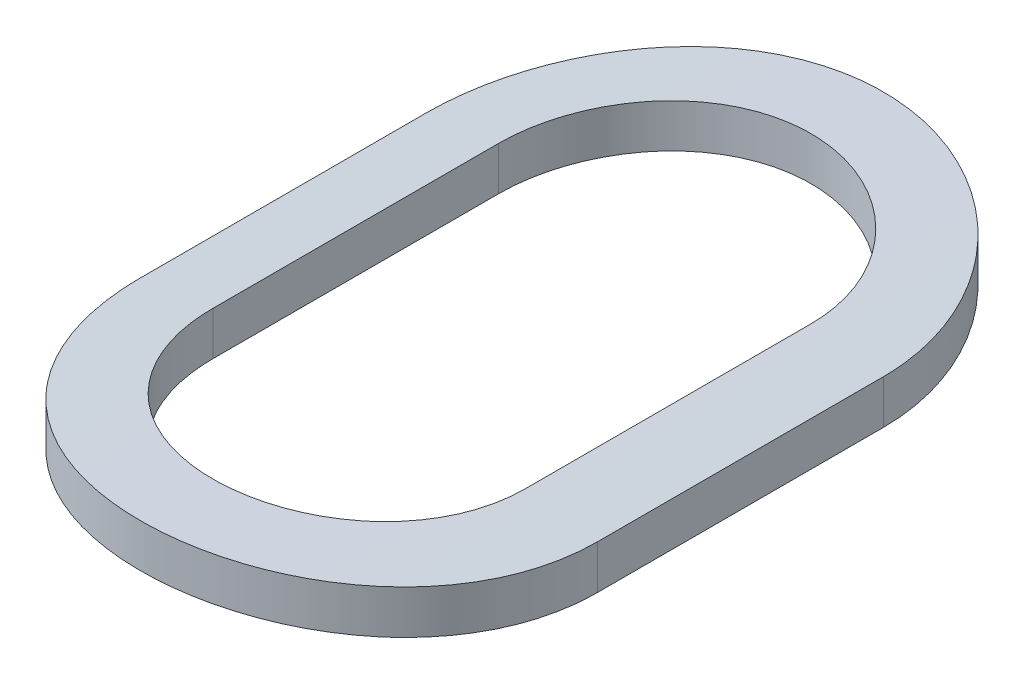
ISO-10303-21;
HEADER;
FILE_DESCRIPTION(('STEP AP214'),'2;1');
FILE_NAME('part.step','',(''),(''),'','','');
FILE_SCHEMA(('AUTOMOTIVE_DESIGN { 1 0 10303 214 1 1 1 1 }'));
ENDSEC;
DATA;
#1=APPLICATION_CONTEXT('core data for automotive mechanical design processes');
#2=APPLICATION_PROTOCOL_DEFINITION('international standard','automotive_design',2000,#1);
#3=PRODUCT_CONTEXT('',#1,'mechanical');
#4=PRODUCT('Part','Part','',(#3));
#5=PRODUCT_RELATED_PRODUCT_CATEGORY('part','',(#4));
#6=PRODUCT_DEFINITION_FORMATION('','',#4);
#7=PRODUCT_DEFINITION_CONTEXT('part definition',#1,'design');
#8=PRODUCT_DEFINITION('design','',#6,#7);
#9=PRODUCT_DEFINITION_SHAPE('','',#8);
#10=(LENGTH_UNIT() NAMED_UNIT(*) SI_UNIT(.MILLI.,.METRE.));
#11=(NAMED_UNIT(*) PLANE_ANGLE_UNIT() SI_UNIT($,.RADIAN.));
#12=(NAMED_UNIT(*) SI_UNIT($,.STERADIAN.) SOLID_ANGLE_UNIT());
#13=UNCERTAINTY_MEASURE_WITH_UNIT(LENGTH_MEASURE(1.E-05),#10,'distance_accuracy_value','');
#14=(GEOMETRIC_REPRESENTATION_CONTEXT(3) GLOBAL_UNCERTAINTY_ASSIGNED_CONTEXT((#13)) GLOBAL_UNIT_ASSIGNED_CONTEXT((#10,
#11,#12)) REPRESENTATION_CONTEXT('',''));
#15=CARTESIAN_POINT('',(0.,0.,0.));
#16=DIRECTION('',(0.,0.,1.));
#17=DIRECTION('',(1.,0.,0.));
#18=AXIS2_PLACEMENT_3D('',#15,#16,#17);
#19=CARTESIAN_POINT('',(-127.9233521598,-34.2539777719783,0.898559059800279));
#20=DIRECTION('',(0.,0.,1.));
#21=DIRECTION('',(1.,0.,0.));
#22=AXIS2_PLACEMENT_3D('',#19,#20,#21);
#23=CYLINDRICAL_SURFACE('',#22,4.);
#24=CARTESIAN_POINT('',(-127.491108186985,-30.2774007077225,-0.678492229661473));
#25=CARTESIAN_POINT('',(-127.491087200258,-30.2774093032285,-0.654250427458844));
#26=CARTESIAN_POINT('',(-127.493146244914,-30.2771792722829,-0.630016399645478));
#27=CARTESIAN_POINT('',(-127.501267711605,-30.2763057606254,-0.582259541124402));
#28=CARTESIAN_POINT('',(-127.507326225035,-30.2756626835923,-0.558736039480907));
#29=CARTESIAN_POINT('',(-127.523293392494,-30.2740263559013,-0.513037676301117));
#30=CARTESIAN_POINT('',(-127.533203439736,-30.2730329785417,-0.490863306145453));
#31=CARTESIAN_POINT('',(-127.556581342248,-30.2708110127297,-0.448494260139316));
#32=CARTESIAN_POINT('',(-127.570048813953,-30.269582449639,-0.428299371181571));
#33=CARTESIAN_POINT('',(-127.600220287064,-30.2670221805073,-0.390377730187716));
#34=CARTESIAN_POINT('',(-127.6169359698,-30.2656901129392,-0.372660295426247));
#35=CARTESIAN_POINT('',(-127.653105985133,-30.2630762167541,-0.340274534345393));
#36=CARTESIAN_POINT('',(-127.672560734073,-30.2617943958128,-0.325606672407616));
#37=CARTESIAN_POINT('',(-127.713713980875,-30.2594218523872,-0.299705735613899));
#38=CARTESIAN_POINT('',(-127.735417823731,-30.2583316025357,-0.288481106240474));
#39=CARTESIAN_POINT('',(-127.780414746846,-30.256469127083,-0.269839910920559));
#40=CARTESIAN_POINT('',(-127.803707686985,-30.2556968734843,-0.262423009712414));
#41=CARTESIAN_POINT('',(-127.851126252775,-30.2545598909362,-0.251634896140753));
#42=CARTESIAN_POINT('',(-127.875248269521,-30.2541935815582,-0.248247990307833));
#43=CARTESIAN_POINT('',(-127.923721524934,-30.2539043752213,-0.245567410692591));
#44=CARTESIAN_POINT('',(-127.948072762323,-30.2539814757901,-0.246273714087672));
#45=CARTESIAN_POINT('',(-127.996205292226,-30.2545691293883,-0.251746959967107));
#46=CARTESIAN_POINT('',(-128.019988542231,-30.2550778685343,-0.256496910034631));
#47=CARTESIAN_POINT('',(-128.066418176187,-30.2564695592699,-0.269896092472021));
#48=CARTESIAN_POINT('',(-128.089064549109,-30.2573525144896,-0.278545362667916));
#49=CARTESIAN_POINT('',(-128.132631413093,-30.2593965328096,-0.299516328549055));
#50=CARTESIAN_POINT('',(-128.153548245803,-30.2605581661113,-0.311845566586497));
#51=CARTESIAN_POINT('',(-128.193021297876,-30.2630292276311,-0.339820407305529));
#52=CARTESIAN_POINT('',(-128.211577539937,-30.2643386544278,-0.355465978094735));
#53=CARTESIAN_POINT('',(-128.245901026669,-30.266966287132,-0.389722565962681));
#54=CARTESIAN_POINT('',(-128.261653919007,-30.2682845042808,-0.40834796571011));
#55=CARTESIAN_POINT('',(-128.289816419944,-30.270774951853,-0.447992642075992));
#56=CARTESIAN_POINT('',(-128.302225018855,-30.2719471381304,-0.469012638937776));
#57=CARTESIAN_POINT('',(-128.323347957904,-30.2740134538802,-0.512867802689183));
#58=CARTESIAN_POINT('',(-128.33205911907,-30.2749073439047,-0.535704511598386));
#59=CARTESIAN_POINT('',(-128.345502485206,-30.2763104155069,-0.582500581006866));
#60=CARTESIAN_POINT('',(-128.350240700685,-30.2768201780969,-0.606458187554227));
#61=CARTESIAN_POINT('',(-128.354711987777,-30.2773050457113,-0.646526456869653));
#62=CARTESIAN_POINT('',(-128.355603730248,-30.2774034970037,-0.662513193898364));
#63=CARTESIAN_POINT('',(-128.355596132613,-30.2774007077223,-0.67849222966147));
#64=B_SPLINE_CURVE_WITH_KNOTS('',3,(#24,#25,#26,#27,#28,#29,#30,#31,#32,#33,#34,#35,#36,#37,#38,
#39,#40,#41,#42,#43,#44,#45,#46,#47,#48,#49,#50,#51,#52,#53,#54,#55,#56,#57,#58,#59,#60,#61,#62,
#63),.UNSPECIFIED.,.F.,.F.,(4,2,2,2,2,2,2,2,2,2,2,2,2,2,2,2,2,2,2,4),(0.,0.0726256062913221,
0.145180341787481,0.217761346895157,0.290334529464338,0.363173700807065,0.436023955812665,
0.509051493289566,0.582072599757544,0.654808409475988,0.727543813640143,0.799975065682708,
0.87240702037229,0.94498846092771,1.01756920351632,1.09051146956909,1.1634757333035,
1.23650260356939,1.30941879404998,1.35735159725356),.UNSPECIFIED.);
#65=CARTESIAN_POINT('',(-127.491108186986,-30.2774007077225,-0.678492229661475));
#66=VERTEX_POINT('',#65);
#67=CARTESIAN_POINT('',(-128.355596132613,-30.2774007077223,-0.678492229661471));
#68=VERTEX_POINT('',#67);
#69=EDGE_CURVE('E173',#66,#68,#64,.T.);
#70=ORIENTED_EDGE('',*,*,#69,.T.);
#71=DIRECTION('',(0.,0.,-1.));
#72=VECTOR('',#71,1.);
#73=CARTESIAN_POINT('',(-128.355596132613,-30.2774007077224,-1.46918242298188));
#74=LINE('',#73,#72);
#75=CARTESIAN_POINT('',(-128.355596132613,-30.2774007077223,-1.46918242298188));
#76=VERTEX_POINT('',#75);
#77=EDGE_CURVE('E111',#76,#68,#74,.F.);
#78=ORIENTED_EDGE('',*,*,#77,.F.);
#79=CARTESIAN_POINT('',(-128.355596132613,-30.2774007077223,-1.46918242298188));
#80=CARTESIAN_POINT('',(-128.355617122564,-30.2774093031018,-1.49342415054568));
#81=CARTESIAN_POINT('',(-128.353558088976,-30.2771792736354,-1.51765810390605));
#82=CARTESIAN_POINT('',(-128.34543664358,-30.2763057646065,-1.5654149666154));
#83=CARTESIAN_POINT('',(-128.339378115823,-30.2756626861869,-1.58893854268274));
#84=CARTESIAN_POINT('',(-128.323410759997,-30.2740263383596,-1.63463746424229));
#85=CARTESIAN_POINT('',(-128.313500468394,-30.2730329358544,-1.65681229355002));
#86=CARTESIAN_POINT('',(-128.290122387864,-30.2708109602008,-1.69918125964866));
#87=CARTESIAN_POINT('',(-128.276655134346,-30.2695824224535,-1.71937569391018));
#88=CARTESIAN_POINT('',(-128.246485774422,-30.2670223239816,-1.75729478754693));
#89=CARTESIAN_POINT('',(-128.229772278111,-30.2656904107285,-1.77501036152478));
#90=CARTESIAN_POINT('',(-128.193602531438,-30.2630765062061,-1.80739683876145));
#91=CARTESIAN_POINT('',(-128.174145251963,-30.2617945338993,-1.82206659449569));
#92=CARTESIAN_POINT('',(-128.132979806713,-30.2594212030672,-1.84797588352839));
#93=CARTESIAN_POINT('',(-128.111265352569,-30.2583304011072,-1.85920546999588));
#94=CARTESIAN_POINT('',(-128.06626175851,-30.256468301793,-1.87784310001373));
#95=CARTESIAN_POINT('',(-128.042974493225,-30.2556966316194,-1.88525560529048));
#96=CARTESIAN_POINT('',(-128.003525585014,-30.2547502618519,-1.89423234228376));
#97=CARTESIAN_POINT('',(-127.98761455235,-30.2544619567995,-1.89692632382276));
#98=CARTESIAN_POINT('',(-127.955588715831,-30.2540756112706,-1.90052371061653));
#99=CARTESIAN_POINT('',(-127.939473908818,-30.2539775737453,-1.90142708809717));
#100=CARTESIAN_POINT('',(-127.899148198746,-30.2539780695901,-1.90142535642738));
#101=CARTESIAN_POINT('',(-127.874928590604,-30.2541997878823,-1.89938656879106));
#102=CARTESIAN_POINT('',(-127.827162093491,-30.2550629316294,-1.89128473995331));
#103=CARTESIAN_POINT('',(-127.803615946452,-30.2557048026716,-1.88521742625408));
#104=CARTESIAN_POINT('',(-127.75789437027,-30.2573358336209,-1.86923797188848));
#105=CARTESIAN_POINT('',(-127.735718096663,-30.2583247770098,-1.85932822788572));
#106=CARTESIAN_POINT('',(-127.693347746542,-30.2605395731461,-1.83594976445062));
#107=CARTESIAN_POINT('',(-127.6731533329,-30.2617653854947,-1.82248165176366));
#108=CARTESIAN_POINT('',(-127.635232215171,-30.2643224002451,-1.79230932929429));
#109=CARTESIAN_POINT('',(-127.617514873633,-30.2656539741726,-1.77559338359708));
#110=CARTESIAN_POINT('',(-127.585130542844,-30.2682694573902,-1.73942346959317));
#111=CARTESIAN_POINT('',(-127.570463816169,-30.2695533625694,-1.71996926583743));
#112=CARTESIAN_POINT('',(-127.544561149847,-30.2719321143964,-1.67881358279141));
#113=CARTESIAN_POINT('',(-127.533334696151,-30.273026434754,-1.65710610696892));
#114=CARTESIAN_POINT('',(-127.514694899956,-30.2748965279096,-1.61210325687928));
#115=CARTESIAN_POINT('',(-127.507279455028,-30.2756724762971,-1.58880876617573));
#116=CARTESIAN_POINT('',(-127.498299357738,-30.2766239966667,-1.54934191245781));
#117=CARTESIAN_POINT('',(-127.495604627655,-30.2769138194439,-1.53342024600916));
#118=CARTESIAN_POINT('',(-127.492009108139,-30.2773027678915,-1.50139550136582));
#119=CARTESIAN_POINT('',(-127.491105867911,-30.2774021540767,-1.48529270135608));
#120=CARTESIAN_POINT('',(-127.491108186985,-30.2774007077225,-1.46918242298189));
#121=B_SPLINE_CURVE_WITH_KNOTS('',3,(#79,#80,#81,#82,#83,#84,#85,#86,#87,#88,#89,#90,#91,#92,
#93,#94,#95,#96,#97,#98,#99,#100,#101,#102,#103,#104,#105,#106,#107,#108,#109,#110,#111,#112,
#113,#114,#115,#116,#117,#118,#119,#120),.UNSPECIFIED.,.F.,.F.,(4,2,2,2,2,2,2,2,2,2,2,2,2,2,2,2,
2,2,2,2,4),(0.,0.0726253836740625,0.145180341790967,0.217762895225315,0.290334529446832,
0.363165547703871,0.436023955754678,0.509091078909627,0.582072600070017,0.630397888655173,
0.678723926810379,0.751276944723523,0.82390703271124,0.896491891356268,0.969064381374194,
1.04190415719804,1.11475019997867,1.18779533226152,1.26080012417626,1.30915708875173,
1.3574478542525),.UNSPECIFIED.);
#122=CARTESIAN_POINT('',(-127.491108186986,-30.2774007077225,-1.46918242298188));
#123=VERTEX_POINT('',#122);
#124=EDGE_CURVE('E118',#76,#123,#121,.T.);
#125=ORIENTED_EDGE('',*,*,#124,.T.);
#126=DIRECTION('',(0.,0.,1.));
#127=VECTOR('',#126,1.);
#128=CARTESIAN_POINT('',(-127.491108186986,-30.2774007077225,-0.678492229661472));
#129=LINE('',#128,#127);
#130=EDGE_CURVE('E115',#66,#123,#129,.F.);
#131=ORIENTED_EDGE('',*,*,#130,.F.);
#132=EDGE_LOOP('',(#70,#78,#125,#131));
#133=FACE_BOUND('',#132,.T.);
#134=DIRECTION('',(0.,0.,-1.));
#135=VECTOR('',#134,1.);
#136=CARTESIAN_POINT('',(-127.291108186986,-30.304260369576,-1.46918251399186));
#137=LINE('',#136,#135);
#138=CARTESIAN_POINT('',(-127.291108186985,-30.304260369576,-1.46918251399186));
#139=VERTEX_POINT('',#138);
#140=CARTESIAN_POINT('',(-127.291108186986,-30.304260369576,-0.678492222405798));
#141=VERTEX_POINT('',#140);
#142=EDGE_CURVE('E98',#139,#141,#137,.F.);
#143=ORIENTED_EDGE('',*,*,#142,.F.);
#144=CARTESIAN_POINT('',(-128.555596132613,-30.3042603695757,-1.46918243749322));
#145=CARTESIAN_POINT('',(-128.555627387224,-30.304278876853,-1.50451563856536));
#146=CARTESIAN_POINT('',(-128.552636208905,-30.3037867472112,-1.5398347591886));
#147=CARTESIAN_POINT('',(-128.540845617514,-30.3019193841848,-1.60942257604523));
#148=CARTESIAN_POINT('',(-128.532053460947,-30.3005452541621,-1.64369252872289));
#149=CARTESIAN_POINT('',(-128.508893430181,-30.2970509632074,-1.71026159363773));
#150=CARTESIAN_POINT('',(-128.494524093114,-30.2949306065573,-1.74256018622211));
#151=CARTESIAN_POINT('',(-128.460637675144,-30.2901894532235,-1.80428789635168));
#152=CARTESIAN_POINT('',(-128.441120844078,-30.2875686808297,-1.83371715306795));
#153=CARTESIAN_POINT('',(-128.397310962073,-30.2820950700764,-1.88912614048668));
#154=CARTESIAN_POINT('',(-128.372982089938,-30.2792405915695,-1.91507738921828));
#155=CARTESIAN_POINT('',(-128.320306751802,-30.2736351510171,-1.96255547575283));
#156=CARTESIAN_POINT('',(-128.291958802139,-30.2708842276762,-1.98408067243588));
#157=CARTESIAN_POINT('',(-128.231859534902,-30.2657780317078,-2.02220103276066));
#158=CARTESIAN_POINT('',(-128.2000895606,-30.2634251284426,-2.03876709561483));
#159=CARTESIAN_POINT('',(-128.134198211888,-30.2594028405985,-2.06629914583908));
#160=CARTESIAN_POINT('',(-128.100079655864,-30.257732652884,-2.07727171708166));
#161=CARTESIAN_POINT('',(-128.042040752499,-30.2556710021539,-2.09064513687014));
#162=CARTESIAN_POINT('',(-128.018492887691,-30.2550391300323,-2.09468210878325));
#163=CARTESIAN_POINT('',(-127.971084117245,-30.2541923034296,-2.10007326580691));
#164=CARTESIAN_POINT('',(-127.947223208897,-30.2539773525595,-2.10142742768194));
#165=CARTESIAN_POINT('',(-127.888077252383,-30.2539783917651,-2.10142487094913));
#166=CARTESIAN_POINT('',(-127.852780200828,-30.2544493110809,-2.0984640382487));
#167=CARTESIAN_POINT('',(-127.783172405955,-30.2562827320271,-2.08670210872495));
#168=CARTESIAN_POINT('',(-127.748862719994,-30.2576461548607,-2.07789497747521));
#169=CARTESIAN_POINT('',(-127.682250091331,-30.2611114507195,-2.05471166326311));
#170=CARTESIAN_POINT('',(-127.649945514781,-30.2632127129732,-2.04034008545219));
#171=CARTESIAN_POINT('',(-127.588211053602,-30.2679220586317,-2.00644679163103));
#172=CARTESIAN_POINT('',(-127.558780798757,-30.2705300766358,-1.98692574008229));
#173=CARTESIAN_POINT('',(-127.503372072292,-30.275988468317,-1.94310884039466));
#174=CARTESIAN_POINT('',(-127.477421952997,-30.2788405549878,-1.91877735087502));
#175=CARTESIAN_POINT('',(-127.429953718157,-30.2844525234804,-1.86610474526176));
#176=CARTESIAN_POINT('',(-127.408436046607,-30.2872123960421,-1.83776322796602));
#177=CARTESIAN_POINT('',(-127.370328442158,-30.2923445362424,-1.77767940373525));
#178=CARTESIAN_POINT('',(-127.353767568818,-30.2947144827996,-1.74591847120112));
#179=CARTESIAN_POINT('',(-127.326234149324,-30.2987729765585,-1.68002693879168));
#180=CARTESIAN_POINT('',(-127.315258267424,-30.3004619303711,-1.64589776727007));
#181=CARTESIAN_POINT('',(-127.301882817932,-30.3025469725133,-1.58783702458438));
#182=CARTESIAN_POINT('',(-127.297846071149,-30.3031860821504,-1.56427831314187));
#183=CARTESIAN_POINT('',(-127.292458430091,-30.3040442096806,-1.5168774970522));
#184=CARTESIAN_POINT('',(-127.291104271006,-30.3042637382083,-1.49303577245536));
#185=CARTESIAN_POINT('',(-127.291108186985,-30.304260369576,-1.46918251399186));
#186=B_SPLINE_CURVE_WITH_KNOTS('',3,(#144,#145,#146,#147,#148,#149,#150,#151,#152,#153,#154,
#155,#156,#157,#158,#159,#160,#161,#162,#163,#164,#165,#166,#167,#168,#169,#170,#171,#172,#173,
#174,#175,#176,#177,#178,#179,#180,#181,#182,#183,#184,#185),.UNSPECIFIED.,.F.,.F.,(4,2,2,2,2,2,
2,2,2,2,2,2,2,2,2,2,2,2,2,2,4),(0.,0.10584873093635,0.211565304981317,0.317309626744838,
0.423048817048477,0.529606959470449,0.636204541237356,0.743415911855355,0.850500795226743,
0.922054105040371,0.993608034566652,1.0993452490884,1.20519177339648,1.31095088542601,
1.41669635751572,1.52325684616698,1.62982800371311,1.73701222616169,1.84413235534829,
1.91571776442044,1.98721599769587),.UNSPECIFIED.);
#187=CARTESIAN_POINT('',(-128.555596132613,-30.3042603695758,-1.46918243023755));
#188=VERTEX_POINT('',#187);
#189=EDGE_CURVE('E21',#188,#139,#186,.T.);
#190=ORIENTED_EDGE('',*,*,#189,.F.);
#191=DIRECTION('',(0.,0.,1.));
#192=VECTOR('',#191,1.);
#193=CARTESIAN_POINT('',(-128.555596132613,-30.3042603695758,-0.67849220063878));
#194=LINE('',#193,#192);
#195=CARTESIAN_POINT('',(-128.555596132613,-30.3042603695758,-0.678492200638779));
#196=VERTEX_POINT('',#195);
#197=EDGE_CURVE('E85',#196,#188,#194,.F.);
#198=ORIENTED_EDGE('',*,*,#197,.F.);
#199=CARTESIAN_POINT('',(-127.291108186985,-30.304260369576,-0.678492215150125));
#200=CARTESIAN_POINT('',(-127.29107693703,-30.3042788770945,-0.643158927555719));
#201=CARTESIAN_POINT('',(-127.294068127674,-30.3037867449222,-0.607839720603105));
#202=CARTESIAN_POINT('',(-127.305858742712,-30.3019193774029,-0.538251908598254));
#203=CARTESIAN_POINT('',(-127.314650882257,-30.3005452497274,-0.503982042190333));
#204=CARTESIAN_POINT('',(-127.33781065848,-30.2970509989242,-0.437413736672873));
#205=CARTESIAN_POINT('',(-127.352179658213,-30.2949306934332,-0.405115781758507));
#206=CARTESIAN_POINT('',(-127.386065829202,-30.2901895600897,-0.343387961332757));
#207=CARTESIAN_POINT('',(-127.405582960091,-30.2875687361618,-0.313958073335259));
#208=CARTESIAN_POINT('',(-127.449395817742,-30.2820947718338,-0.258545479319057));
#209=CARTESIAN_POINT('',(-127.473727782055,-30.2792399723179,-0.232591584531878));
#210=CARTESIAN_POINT('',(-127.526403495189,-30.2736345485693,-0.18511450890375));
#211=CARTESIAN_POINT('',(-127.554747856826,-30.2708839403314,-0.163592006106396));
#212=CARTESIAN_POINT('',(-127.614829672193,-30.2657794047655,-0.12548369846993));
#213=CARTESIAN_POINT('',(-127.646584412438,-30.2634276707934,-0.10892482863624));
#214=CARTESIAN_POINT('',(-127.712466070859,-30.25940459693,-0.0813876542377014));
#215=CARTESIAN_POINT('',(-127.746592713534,-30.2577331781726,-0.0704087027800598));
#216=CARTESIAN_POINT('',(-127.815950500318,-30.2552706736928,-0.0544303435741779));
#217=CARTESIAN_POINT('',(-127.851170123094,-30.2544723948262,-0.0493820515899703));
#218=CARTESIAN_POINT('',(-127.92196581868,-30.2538214254185,-0.0452563939821925));
#219=CARTESIAN_POINT('',(-127.95754187804,-30.2539686993305,-0.0461788038984308));
#220=CARTESIAN_POINT('',(-128.027704865255,-30.2551865542934,-0.0539302205789864));
#221=CARTESIAN_POINT('',(-128.062297785524,-30.2562488876718,-0.0607064667564071));
#222=CARTESIAN_POINT('',(-128.129849092161,-30.2591682960876,-0.0798902239233377));
#223=CARTESIAN_POINT('',(-128.162807442808,-30.2610253884849,-0.0922978579186966));
#224=CARTESIAN_POINT('',(-128.226313208968,-30.2653398033245,-0.122445685724618));
#225=CARTESIAN_POINT('',(-128.256849964925,-30.2677996035833,-0.140207964494242));
#226=CARTESIAN_POINT('',(-128.314528173285,-30.2730455572148,-0.180544078202811));
#227=CARTESIAN_POINT('',(-128.341669508062,-30.2758317218872,-0.203118079759076));
#228=CARTESIAN_POINT('',(-128.392095765048,-30.2814557389835,-0.252726671240875));
#229=CARTESIAN_POINT('',(-128.415335898095,-30.2842938247062,-0.279806779361963));
#230=CARTESIAN_POINT('',(-128.456955927425,-30.2896734240352,-0.337515573170806));
#231=CARTESIAN_POINT('',(-128.475334426147,-30.292214852245,-0.368145275619697));
#232=CARTESIAN_POINT('',(-128.50671684419,-30.2967137751545,-0.43213722442191));
#233=CARTESIAN_POINT('',(-128.519712634031,-30.2986703853747,-0.465503513444074));
#234=CARTESIAN_POINT('',(-128.539884318288,-30.3017639618722,-0.533959986923119));
#235=CARTESIAN_POINT('',(-128.547068925715,-30.3029021549599,-0.569047506547061));
#236=CARTESIAN_POINT('',(-128.552696444625,-30.3037971684178,-0.616747552346108));
#237=CARTESIAN_POINT('',(-128.5537842964,-30.3039707212086,-0.629081702211272));
#238=CARTESIAN_POINT('',(-128.555233186943,-30.3042022005102,-0.653772849523914));
#239=CARTESIAN_POINT('',(-128.55559544791,-30.304260321455,-0.666129773399742));
#240=CARTESIAN_POINT('',(-128.555596132613,-30.3042603695757,-0.678492200638778));
#241=B_SPLINE_CURVE_WITH_KNOTS('',3,(#199,#200,#201,#202,#203,#204,#205,#206,#207,#208,#209,
#210,#211,#212,#213,#214,#215,#216,#217,#218,#219,#220,#221,#222,#223,#224,#225,#226,#227,#228,
#229,#230,#231,#232,#233,#234,#235,#236,#237,#238,#239,#240),.UNSPECIFIED.,.F.,.F.,(4,2,2,2,2,2,
2,2,2,2,2,2,2,2,2,2,2,2,2,2,4),(0.,0.105848989046621,0.211565304974137,0.317307475588212,
0.423048817099693,0.529618532219082,0.636204541383861,0.743358880401749,0.850500793934955,
0.956753238060073,1.06300168779628,1.16830239507935,1.2736054025461,1.37934881120724,
1.48509588207985,1.59198440577073,1.69890362310571,1.80598373634124,1.91290299954314,
1.950036451473,1.98710730238442),.UNSPECIFIED.);
#242=EDGE_CURVE('E99',#141,#196,#241,.T.);
#243=ORIENTED_EDGE('',*,*,#242,.F.);
#244=EDGE_LOOP('',(#143,#190,#198,#243));
#245=FACE_BOUND('',#244,.T.);
#246=ADVANCED_FACE('F17',(#133,#245),#23,.T.);
#247=CARTESIAN_POINT('',(-127.291108186986,-36.1825523620957,-1.46918251399186));
#248=DIRECTION('',(1.,0.,0.));
#249=DIRECTION('',(0.,0.,-1.));
#250=AXIS2_PLACEMENT_3D('',#247,#248,#249);
#251=PLANE('',#250);
#252=ORIENTED_EDGE('',*,*,#142,.T.);
#253=DIRECTION('',(0.,-1.,0.));
#254=VECTOR('',#253,1.);
#255=CARTESIAN_POINT('',(-127.291108186985,-36.1825523620957,-0.678492215150126));
#256=LINE('',#255,#254);
#257=CARTESIAN_POINT('',(-127.291108186986,-30.4258362439206,-0.678492222405798));
#258=VERTEX_POINT('',#257);
#259=EDGE_CURVE('E168',#258,#141,#256,.F.);
#260=ORIENTED_EDGE('',*,*,#259,.F.);
#261=DIRECTION('',(0.,0.,1.));
#262=VECTOR('',#261,1.);
#263=CARTESIAN_POINT('',(-127.291108186986,-30.4258362439206,0.898559059800279));
#264=LINE('',#263,#262);
#265=CARTESIAN_POINT('',(-127.291108186985,-30.4258362439206,-1.46918251399186));
#266=VERTEX_POINT('',#265);
#267=EDGE_CURVE('E106',#258,#266,#264,.F.);
#268=ORIENTED_EDGE('',*,*,#267,.T.);
#269=DIRECTION('',(0.,-1.,0.));
#270=VECTOR('',#269,1.);
#271=CARTESIAN_POINT('',(-127.291108186985,-36.1825523620957,-1.46918251399186));
#272=LINE('',#271,#270);
#273=EDGE_CURVE('E93',#139,#266,#272,.T.);
#274=ORIENTED_EDGE('',*,*,#273,.F.);
#275=EDGE_LOOP('',(#252,#260,#268,#274));
#276=FACE_BOUND('',#275,.T.);
#277=ADVANCED_FACE('F105',(#276),#251,.T.);
#278=CARTESIAN_POINT('',(-127.923352159799,-36.1825523620957,-1.46918242298188));
#279=DIRECTION('',(0.,-1.,0.));
#280=DIRECTION('',(0.,0.,-1.));
#281=AXIS2_PLACEMENT_3D('',#278,#279,#280);
#282=CYLINDRICAL_SURFACE('',#281,0.632243972813892);
#283=CARTESIAN_POINT('',(-127.291108186985,-30.4258362439207,-1.46918251399186));
#284=CARTESIAN_POINT('',(-127.29107687203,-30.4258553372712,-1.50450091555067));
#285=CARTESIAN_POINT('',(-127.294065627132,-30.425347987169,-1.53980491466845));
#286=CARTESIAN_POINT('',(-127.305845769865,-30.4234230482252,-1.60936126567508));
#287=CARTESIAN_POINT('',(-127.314629717331,-30.4220066265596,-1.64361490713702));
#288=CARTESIAN_POINT('',(-127.337766718273,-30.4184050685595,-1.7101514848709));
#289=CARTESIAN_POINT('',(-127.352121155065,-30.4162197412957,-1.74243392933017));
#290=CARTESIAN_POINT('',(-127.385971199564,-30.4113334996578,-1.80413259029011));
#291=CARTESIAN_POINT('',(-127.405466619181,-30.4086326041474,-1.83354891159817));
#292=CARTESIAN_POINT('',(-127.449238847324,-30.4029901587619,-1.88895120817628));
#293=CARTESIAN_POINT('',(-127.473553722625,-30.4000468096386,-1.91490692727455));
#294=CARTESIAN_POINT('',(-127.526201707093,-30.3942664314077,-1.96239739628776));
#295=CARTESIAN_POINT('',(-127.554536297595,-30.3914294419849,-1.98393050920133));
#296=CARTESIAN_POINT('',(-127.614622019028,-30.3861618519328,-2.02207717499073));
#297=CARTESIAN_POINT('',(-127.646392950447,-30.3837338378389,-2.03865989380694));
#298=CARTESIAN_POINT('',(-127.712291927276,-30.379582461092,-2.06622404507927));
#299=CARTESIAN_POINT('',(-127.746417145187,-30.3778582697949,-2.07721206822913));
#300=CARTESIAN_POINT('',(-127.804495859424,-30.375728338768,-2.09061436685628));
#301=CARTESIAN_POINT('',(-127.82807618238,-30.3750750783192,-2.09466282156496));
#302=CARTESIAN_POINT('',(-127.875551675841,-30.3741995773534,-2.10006936353081));
#303=CARTESIAN_POINT('',(-127.899446848804,-30.3739773402025,-2.10142742977811));
#304=CARTESIAN_POINT('',(-127.958612023302,-30.3739784088391,-2.10142487069215));
#305=CARTESIAN_POINT('',(-127.993893942774,-30.3744634768632,-2.09846653201423));
#306=CARTESIAN_POINT('',(-128.063471205737,-30.3763519998967,-2.08671497400865));
#307=CARTESIAN_POINT('',(-128.097765495174,-30.3777564007213,-2.07791574540745));
#308=CARTESIAN_POINT('',(-128.164347128755,-30.3813259386316,-2.05475463386087));
#309=CARTESIAN_POINT('',(-128.196636152727,-30.3834904285853,-2.04039748181338));
#310=CARTESIAN_POINT('',(-128.258342358772,-30.3883418932907,-2.00653954134357));
#311=CARTESIAN_POINT('',(-128.287759897164,-30.3910288030919,-1.98703939222495));
#312=CARTESIAN_POINT('',(-128.343161459837,-30.3966544846913,-1.94325966782181));
#313=CARTESIAN_POINT('',(-128.369115448681,-30.3995951359185,-1.91894232340304));
#314=CARTESIAN_POINT('',(-128.416594959663,-30.4053825704983,-1.86629756052414));
#315=CARTESIAN_POINT('',(-128.43812002976,-30.4082293442444,-1.83796973322888));
#316=CARTESIAN_POINT('',(-128.4762534154,-30.4135254042076,-1.77789969141883));
#317=CARTESIAN_POINT('',(-128.49283083649,-30.4159721513683,-1.74613764321392));
#318=CARTESIAN_POINT('',(-128.520396068249,-30.4201631991098,-1.68023829386664));
#319=CARTESIAN_POINT('',(-128.531387247163,-30.4219079228457,-1.64610243817041));
#320=CARTESIAN_POINT('',(-128.54479113382,-30.4240635002151,-1.58800250288125));
#321=CARTESIAN_POINT('',(-128.548839162202,-30.4247247182119,-1.56441201297324));
#322=CARTESIAN_POINT('',(-128.554242041728,-30.4256125839174,-1.51694544646856));
#323=CARTESIAN_POINT('',(-128.555600116494,-30.4258397517774,-1.49306974624511));
#324=CARTESIAN_POINT('',(-128.555596132613,-30.4258362439204,-1.46918243749322));
#325=B_SPLINE_CURVE_WITH_KNOTS('',3,(#283,#284,#285,#286,#287,#288,#289,#290,#291,#292,#293,
#294,#295,#296,#297,#298,#299,#300,#301,#302,#303,#304,#305,#306,#307,#308,#309,#310,#311,#312,
#313,#314,#315,#316,#317,#318,#319,#320,#321,#322,#323,#324),.UNSPECIFIED.,.F.,.F.,(4,2,2,2,2,2,
2,2,2,2,2,2,2,2,2,2,2,2,2,2,4),(0.,0.105803750682362,0.211471928732498,0.317166364113116,
0.422856933044904,0.529418198510909,0.636018836193059,0.743270221080641,0.850394967082617,
0.922050899715295,0.993707391923682,1.09939930845641,1.20520013272278,1.31091109677199,
1.41660892653704,1.52317084867862,1.62974364174851,1.73696861313821,1.84412885591571,
1.91581484100148,1.98741486599118),.UNSPECIFIED.);
#326=CARTESIAN_POINT('',(-128.555596132613,-30.4258362439204,-1.46918243023755));
#327=VERTEX_POINT('',#326);
#328=EDGE_CURVE('E150',#266,#327,#325,.T.);
#329=ORIENTED_EDGE('',*,*,#328,.T.);
#330=DIRECTION('',(0.,1.,0.));
#331=VECTOR('',#330,1.);
#332=CARTESIAN_POINT('',(-128.555596132613,-36.1825523620957,-1.46918243749322));
#333=LINE('',#332,#331);
#334=EDGE_CURVE('E95',#188,#327,#333,.F.);
#335=ORIENTED_EDGE('',*,*,#334,.F.);
#336=ORIENTED_EDGE('',*,*,#189,.T.);
#337=ORIENTED_EDGE('',*,*,#273,.T.);
#338=EDGE_LOOP('',(#329,#335,#336,#337));
#339=FACE_BOUND('',#338,.T.);
#340=ADVANCED_FACE('F91',(#339),#282,.T.);
#341=CARTESIAN_POINT('',(-128.555596132613,-36.1825523620957,-0.67849220063878));
#342=DIRECTION('',(-1.,0.,0.));
#343=DIRECTION('',(0.,0.,1.));
#344=AXIS2_PLACEMENT_3D('',#341,#342,#343);
#345=PLANE('',#344);
#346=ORIENTED_EDGE('',*,*,#197,.T.);
#347=ORIENTED_EDGE('',*,*,#334,.T.);
#348=DIRECTION('',(0.,0.,1.));
#349=VECTOR('',#348,1.);
#350=CARTESIAN_POINT('',(-128.555596132613,-30.4258362439204,0.898559059800279));
#351=LINE('',#350,#349);
#352=CARTESIAN_POINT('',(-128.555596132613,-30.4258362439204,-0.678492200638779));
#353=VERTEX_POINT('',#352);
#354=EDGE_CURVE('E149',#327,#353,#351,.T.);
#355=ORIENTED_EDGE('',*,*,#354,.T.);
#356=DIRECTION('',(0.,-1.,0.));
#357=VECTOR('',#356,1.);
#358=CARTESIAN_POINT('',(-128.555596132613,-36.1825523620957,-0.67849220063878));
#359=LINE('',#358,#357);
#360=EDGE_CURVE('E114',#196,#353,#359,.T.);
#361=ORIENTED_EDGE('',*,*,#360,.F.);
#362=EDGE_LOOP('',(#346,#347,#355,#361));
#363=FACE_BOUND('',#362,.T.);
#364=ADVANCED_FACE('F161',(#363),#345,.T.);
#365=CARTESIAN_POINT('',(-127.923352159799,-36.1825523620957,-0.678492229661472));
#366=DIRECTION('',(0.,-1.,0.));
#367=DIRECTION('',(0.,0.,-1.));
#368=AXIS2_PLACEMENT_3D('',#365,#366,#367);
#369=CYLINDRICAL_SURFACE('',#368,0.63224397281389);
#370=ORIENTED_EDGE('',*,*,#360,.T.);
#371=CARTESIAN_POINT('',(-128.555596132613,-30.4258362439204,-0.678492200638779));
#372=CARTESIAN_POINT('',(-128.555627446382,-30.4258553380892,-0.643173715254313));
#373=CARTESIAN_POINT('',(-128.552638682874,-30.4253479860267,-0.607869632187337));
#374=CARTESIAN_POINT('',(-128.540858524227,-30.4234230436711,-0.538313284899326));
#375=CARTESIAN_POINT('',(-128.532074596736,-30.4220066248651,-0.504059726338859));
#376=CARTESIAN_POINT('',(-128.508937854556,-30.4184051088153,-0.437523899243767));
#377=CARTESIAN_POINT('',(-128.494583756003,-30.4162198343696,-0.405242087161974));
#378=CARTESIAN_POINT('',(-128.460733963134,-30.4113336138359,-0.343543313445617));
#379=CARTESIAN_POINT('',(-128.441238248895,-30.4086326657499,-0.314126362912041));
#380=CARTESIAN_POINT('',(-128.397463064243,-30.4029898575305,-0.258720469574797));
#381=CARTESIAN_POINT('',(-128.373145111878,-30.4000461786285,-0.232762111026835));
#382=CARTESIAN_POINT('',(-128.320496759478,-30.3942658174923,-0.18527264352658));
#383=CARTESIAN_POINT('',(-128.292165745941,-30.3914291517021,-0.163742212735892));
#384=CARTESIAN_POINT('',(-128.232097433943,-30.3861632699046,-0.125607573846055));
#385=CARTESIAN_POINT('',(-128.200341703971,-30.383736459422,-0.109032037694846));
#386=CARTESIAN_POINT('',(-128.134452411851,-30.3795842738066,-0.0814627665017719));
#387=CARTESIAN_POINT('',(-128.100319133782,-30.3778588150417,-0.0704683659028975));
#388=CARTESIAN_POINT('',(-128.030961252363,-30.3753164891915,-0.0544664489868712));
#389=CARTESIAN_POINT('',(-127.995748920492,-30.3744917473888,-0.0494070155169794));
#390=CARTESIAN_POINT('',(-127.924965281575,-30.3738167338891,-0.0452572380154965));
#391=CARTESIAN_POINT('',(-127.889393989427,-30.3739664219127,-0.0461666472534113));
#392=CARTESIAN_POINT('',(-127.819258806539,-30.3752171911045,-0.0538883585158768));
#393=CARTESIAN_POINT('',(-127.784688563162,-30.376309241681,-0.060644632216238));
#394=CARTESIAN_POINT('',(-127.717179328405,-30.3793119546057,-0.0797800864667567));
#395=CARTESIAN_POINT('',(-127.684240374747,-30.3812226358739,-0.0921593969754125));
#396=CARTESIAN_POINT('',(-127.620760641659,-30.3856633721133,-0.122245821894277));
#397=CARTESIAN_POINT('',(-127.590231100592,-30.3881961262514,-0.139976233500994));
#398=CARTESIAN_POINT('',(-127.532560628193,-30.3935992742922,-0.180243871925061));
#399=CARTESIAN_POINT('',(-127.50541983167,-30.3964696816185,-0.20278128987555));
#400=CARTESIAN_POINT('',(-127.454968438095,-30.4022677454514,-0.252330790731112));
#401=CARTESIAN_POINT('',(-127.431705379439,-30.4051956809042,-0.279391264408242));
#402=CARTESIAN_POINT('',(-127.390035882015,-30.410747725104,-0.337066021904351));
#403=CARTESIAN_POINT('',(-127.371630832993,-30.4133717467892,-0.367681319064584));
#404=CARTESIAN_POINT('',(-127.340191069044,-30.4180193375722,-0.431654802259689));
#405=CARTESIAN_POINT('',(-127.327165028717,-30.420041935309,-0.465017315565965));
#406=CARTESIAN_POINT('',(-127.306933612368,-30.4232422208001,-0.53347412699749));
#407=CARTESIAN_POINT('',(-127.299719528978,-30.4244211721927,-0.568565750579843));
#408=CARTESIAN_POINT('',(-127.294045321095,-30.4253521721865,-0.616351058810187));
#409=CARTESIAN_POINT('',(-127.292943429496,-30.425533540373,-0.628764029112049));
#410=CARTESIAN_POINT('',(-127.291475824222,-30.4257754520869,-0.653613600531229));
#411=CARTESIAN_POINT('',(-127.29110887247,-30.4258361988114,-0.666050126520788));
#412=CARTESIAN_POINT('',(-127.291108186985,-30.4258362439207,-0.678492215150125));
#413=B_SPLINE_CURVE_WITH_KNOTS('',3,(#371,#372,#373,#374,#375,#376,#377,#378,#379,#380,#381,
#382,#383,#384,#385,#386,#387,#388,#389,#390,#391,#392,#393,#394,#395,#396,#397,#398,#399,#400,
#401,#402,#403,#404,#405,#406,#407,#408,#409,#410,#411,#412),.UNSPECIFIED.,.F.,.F.,(4,2,2,2,2,2,
2,2,2,2,2,2,2,2,2,2,2,2,2,2,4),(0.,0.10580400076879,0.211471928108136,0.317164225229934,
0.422856931880175,0.52942972808876,0.636018834374674,0.743213292156204,0.850394963867273,
0.956631883182569,1.0628644110733,1.16809008479602,1.27331819059715,1.37901120601079,
1.48470842470677,1.59161882935368,1.6985597851467,1.80567253485948,1.91262451019973,
1.94999712415137,1.98730672722254),.UNSPECIFIED.);
#414=EDGE_CURVE('E142',#353,#258,#413,.T.);
#415=ORIENTED_EDGE('',*,*,#414,.T.);
#416=ORIENTED_EDGE('',*,*,#259,.T.);
#417=ORIENTED_EDGE('',*,*,#242,.T.);
#418=EDGE_LOOP('',(#370,#415,#416,#417));
#419=FACE_BOUND('',#418,.T.);
#420=ADVANCED_FACE('F155',(#419),#369,.T.);
#421=CARTESIAN_POINT('',(-128.355596132613,-36.1825523620957,-1.46918242298188));
#422=DIRECTION('',(1.,0.,0.));
#423=DIRECTION('',(0.,0.,-1.));
#424=AXIS2_PLACEMENT_3D('',#421,#422,#423);
#425=PLANE('',#424);
#426=ORIENTED_EDGE('',*,*,#77,.T.);
#427=DIRECTION('',(0.,-1.,0.));
#428=VECTOR('',#427,1.);
#429=CARTESIAN_POINT('',(-128.355596132613,-36.1825523620957,-0.678492229661472));
#430=LINE('',#429,#428);
#431=CARTESIAN_POINT('',(-128.355596132613,-30.398129597067,-0.678492229661471));
#432=VERTEX_POINT('',#431);
#433=EDGE_CURVE('E211',#68,#432,#430,.T.);
#434=ORIENTED_EDGE('',*,*,#433,.T.);
#435=DIRECTION('',(0.,0.,1.));
#436=VECTOR('',#435,1.);
#437=CARTESIAN_POINT('',(-128.355596132613,-30.398129597067,0.898559059800279));
#438=LINE('',#437,#436);
#439=CARTESIAN_POINT('',(-128.355596132613,-30.398129597067,-1.46918242298188));
#440=VERTEX_POINT('',#439);
#441=EDGE_CURVE('E148',#432,#440,#438,.F.);
#442=ORIENTED_EDGE('',*,*,#441,.T.);
#443=DIRECTION('',(0.,-1.,0.));
#444=VECTOR('',#443,1.);
#445=CARTESIAN_POINT('',(-128.355596132613,-36.1825523620957,-1.46918242298188));
#446=LINE('',#445,#444);
#447=EDGE_CURVE('E113',#440,#76,#446,.F.);
#448=ORIENTED_EDGE('',*,*,#447,.T.);
#449=EDGE_LOOP('',(#426,#434,#442,#448));
#450=FACE_BOUND('',#449,.T.);
#451=ADVANCED_FACE('F160',(#450),#425,.T.);
#452=CARTESIAN_POINT('',(-127.923352159799,-36.1825523620957,-1.46918242298188));
#453=DIRECTION('',(0.,-1.,0.));
#454=DIRECTION('',(0.,0.,-1.));
#455=AXIS2_PLACEMENT_3D('',#452,#453,#454);
#456=CYLINDRICAL_SURFACE('',#455,0.432243972813884);
#457=ORIENTED_EDGE('',*,*,#124,.F.);
#458=ORIENTED_EDGE('',*,*,#447,.F.);
#459=CARTESIAN_POINT('',(-128.355596132613,-30.398129597067,-1.46918242298188));
#460=CARTESIAN_POINT('',(-128.355617143593,-30.398138461391,-1.49341944056627));
#461=CARTESIAN_POINT('',(-128.353558885066,-30.3979013183326,-1.51764858241783));
#462=CARTESIAN_POINT('',(-128.345440780718,-30.3970008343412,-1.56539543040901));
#463=CARTESIAN_POINT('',(-128.339384878891,-30.3963379134896,-1.58891381387709));
#464=CARTESIAN_POINT('',(-128.323424891983,-30.3946511351841,-1.63460239824322));
#465=CARTESIAN_POINT('',(-128.31351936902,-30.3936271428787,-1.65677209180602));
#466=CARTESIAN_POINT('',(-128.290152931766,-30.3913367859817,-1.69913183460087));
#467=CARTESIAN_POINT('',(-128.276692532474,-30.3900704565049,-1.71932217000409));
#468=CARTESIAN_POINT('',(-128.246535176061,-30.3874312779715,-1.75723922149468));
#469=CARTESIAN_POINT('',(-128.22982610312,-30.3860580420778,-1.77495627487205));
#470=CARTESIAN_POINT('',(-128.193664975431,-30.3833629484714,-1.80734680014699));
#471=CARTESIAN_POINT('',(-128.174211892445,-30.3820411102564,-1.82201912600699));
#472=CARTESIAN_POINT('',(-128.133050680001,-30.379593623306,-1.84793680148066));
#473=CARTESIAN_POINT('',(-128.111335913307,-30.3784685795403,-1.85917166054734));
#474=CARTESIAN_POINT('',(-128.066329892415,-30.3765478765735,-1.87781944664759));
#475=CARTESIAN_POINT('',(-128.043040515697,-30.3757518328769,-1.88523683757818));
#476=CARTESIAN_POINT('',(-128.003578933929,-30.3747752200699,-1.89422267943797));
#477=CARTESIAN_POINT('',(-127.987657563821,-30.3744776019595,-1.89692026775504));
#478=CARTESIAN_POINT('',(-127.955610498405,-30.3740787743024,-1.90052248605246));
#479=CARTESIAN_POINT('',(-127.939484800006,-30.3739775677314,-1.90142708886887));
#480=CARTESIAN_POINT('',(-127.899153055173,-30.3739780783505,-1.9014253561799));
#481=CARTESIAN_POINT('',(-127.874938331296,-30.3742065617847,-1.89938737651732));
#482=CARTESIAN_POINT('',(-127.827181691776,-30.3750960459599,-1.89128890974641));
#483=CARTESIAN_POINT('',(-127.803640517019,-30.3757575052113,-1.88522415829135));
#484=CARTESIAN_POINT('',(-127.75792895546,-30.3774383313766,-1.86925191024035));
#485=CARTESIAN_POINT('',(-127.735757708889,-30.3784574710701,-1.85934685282352));
#486=CARTESIAN_POINT('',(-127.693396466799,-30.3807399867704,-1.83597987159556));
#487=CARTESIAN_POINT('',(-127.673206138948,-30.3820033217033,-1.82251854581361));
#488=CARTESIAN_POINT('',(-127.6352871577,-30.3846390968795,-1.79235817127819));
#489=CARTESIAN_POINT('',(-127.617568431698,-30.3860119441671,-1.77564667651008));
#490=CARTESIAN_POINT('',(-127.585180218677,-30.3887087594235,-1.73948545719075));
#491=CARTESIAN_POINT('',(-127.570510996228,-30.3900327231432,-1.72003549530106));
#492=CARTESIAN_POINT('',(-127.544600013857,-30.3924861836676,-1.67888406369998));
#493=CARTESIAN_POINT('',(-127.53336829998,-30.3936151063601,-1.65717623851949));
#494=CARTESIAN_POINT('',(-127.514718393283,-30.3955445537707,-1.61217092701874));
#495=CARTESIAN_POINT('',(-127.507298088692,-30.3963452602923,-1.58887432910598));
#496=CARTESIAN_POINT('',(-127.498308964035,-30.3973275070233,-1.54939493445786));
#497=CARTESIAN_POINT('',(-127.49561066283,-30.3976267939652,-1.53346306573967));
#498=CARTESIAN_POINT('',(-127.492010325027,-30.398028454328,-1.50141725400006));
#499=CARTESIAN_POINT('',(-127.491105848784,-30.3981310951858,-1.48530358828351));
#500=CARTESIAN_POINT('',(-127.491108186985,-30.3981295970672,-1.46918242298188));
#501=B_SPLINE_CURVE_WITH_KNOTS('',3,(#459,#460,#461,#462,#463,#464,#465,#466,#467,#468,#469,
#470,#471,#472,#473,#474,#475,#476,#477,#478,#479,#480,#481,#482,#483,#484,#485,#486,#487,#488,
#489,#490,#491,#492,#493,#494,#495,#496,#497,#498,#499,#500),.UNSPECIFIED.,.F.,.F.,(4,2,2,2,2,2,
2,2,2,2,2,2,2,2,2,2,2,2,2,2,4),(0.,0.0726110703568819,0.145150610932123,0.217717272017479,
0.290273426057524,0.363105554309547,0.435965047098439,0.509044726041049,0.582038755124299,
0.630396664646979,0.678755306791638,0.751293702605121,0.823909039280886,0.896478329517966,
0.969035424117945,1.04187603897329,1.1147229706965,1.18778080670378,1.26079812010336,
1.30918729504396,1.35751061429023),.UNSPECIFIED.);
#502=CARTESIAN_POINT('',(-127.491108186986,-30.3981295970671,-1.46918242298188));
#503=VERTEX_POINT('',#502);
#504=EDGE_CURVE('E125',#440,#503,#501,.T.);
#505=ORIENTED_EDGE('',*,*,#504,.T.);
#506=DIRECTION('',(0.,1.,0.));
#507=VECTOR('',#506,1.);
#508=CARTESIAN_POINT('',(-127.491108186986,-36.1825523620957,-1.46918242298188));
#509=LINE('',#508,#507);
#510=EDGE_CURVE('E117',#123,#503,#509,.F.);
#511=ORIENTED_EDGE('',*,*,#510,.F.);
#512=EDGE_LOOP('',(#457,#458,#505,#511));
#513=FACE_BOUND('',#512,.T.);
#514=ADVANCED_FACE('F177',(#513),#456,.F.);
#515=CARTESIAN_POINT('',(-127.491108186986,-36.1825523620957,-0.678492229661472));
#516=DIRECTION('',(-1.,0.,0.));
#517=DIRECTION('',(0.,0.,1.));
#518=AXIS2_PLACEMENT_3D('',#515,#516,#517);
#519=PLANE('',#518);
#520=ORIENTED_EDGE('',*,*,#130,.T.);
#521=ORIENTED_EDGE('',*,*,#510,.T.);
#522=DIRECTION('',(0.,0.,1.));
#523=VECTOR('',#522,1.);
#524=CARTESIAN_POINT('',(-127.491108186986,-30.3981295970671,0.898559059800279));
#525=LINE('',#524,#523);
#526=CARTESIAN_POINT('',(-127.491108186985,-30.3981295970672,-0.678492229661471));
#527=VERTEX_POINT('',#526);
#528=EDGE_CURVE('E31',#503,#527,#525,.T.);
#529=ORIENTED_EDGE('',*,*,#528,.T.);
#530=DIRECTION('',(0.,-1.,0.));
#531=VECTOR('',#530,1.);
#532=CARTESIAN_POINT('',(-127.491108186985,-36.1825523620957,-0.678492229661472));
#533=LINE('',#532,#531);
#534=EDGE_CURVE('E39',#527,#66,#533,.F.);
#535=ORIENTED_EDGE('',*,*,#534,.T.);
#536=EDGE_LOOP('',(#520,#521,#529,#535));
#537=FACE_BOUND('',#536,.T.);
#538=ADVANCED_FACE('F180',(#537),#519,.T.);
#539=CARTESIAN_POINT('',(-127.923352159799,-36.1825523620957,-0.678492229661472));
#540=DIRECTION('',(0.,-1.,0.));
#541=DIRECTION('',(0.,0.,-1.));
#542=AXIS2_PLACEMENT_3D('',#539,#540,#541);
#543=CYLINDRICAL_SURFACE('',#542,0.43224397281389);
#544=ORIENTED_EDGE('',*,*,#433,.F.);
#545=ORIENTED_EDGE('',*,*,#69,.F.);
#546=ORIENTED_EDGE('',*,*,#534,.F.);
#547=CARTESIAN_POINT('',(-127.491108186985,-30.3981295970672,-0.678492229661471));
#548=CARTESIAN_POINT('',(-127.491087179227,-30.3981384615208,-0.654255138314362));
#549=CARTESIAN_POINT('',(-127.493145448671,-30.3979013169548,-0.630025922883014));
#550=CARTESIAN_POINT('',(-127.501263574024,-30.3970008302843,-0.582279079030988));
#551=CARTESIAN_POINT('',(-127.507319461675,-30.3963379108452,-0.558760769112898));
#552=CARTESIAN_POINT('',(-127.523279261025,-30.3946511532195,-0.513072740926459));
#553=CARTESIAN_POINT('',(-127.533184540396,-30.3936271867665,-0.490903505220328));
#554=CARTESIAN_POINT('',(-127.556550800144,-30.3913368399867,-0.448543682770268));
#555=CARTESIAN_POINT('',(-127.570011416884,-30.3900704844551,-0.428352893961439));
#556=CARTESIAN_POINT('',(-127.600170882108,-30.3874311302914,-0.39043329962537));
#557=CARTESIAN_POINT('',(-127.61688213747,-30.3860577355526,-0.372714388312759));
#558=CARTESIAN_POINT('',(-127.65304353314,-30.3833626505135,-0.34032457780671));
#559=CARTESIAN_POINT('',(-127.672494089871,-30.3820409681135,-0.325654142877606));
#560=CARTESIAN_POINT('',(-127.713643118505,-30.379594292289,-0.299744813580071));
#561=CARTESIAN_POINT('',(-127.735347284612,-30.3784698173995,-0.288514909526345));
#562=CARTESIAN_POINT('',(-127.78034663698,-30.3765487271556,-0.269863561490593));
#563=CARTESIAN_POINT('',(-127.803641680531,-30.375752082438,-0.26244177640601));
#564=CARTESIAN_POINT('',(-127.85106012114,-30.3745791444223,-0.251646217455929));
#565=CARTESIAN_POINT('',(-127.87517967778,-30.3742011197578,-0.24825576611147));
#566=CARTESIAN_POINT('',(-127.92364880287,-30.3739021121989,-0.245567461354318));
#567=CARTESIAN_POINT('',(-127.947998369627,-30.373981125943,-0.246269577841495));
#568=CARTESIAN_POINT('',(-127.99612168111,-30.3745858992713,-0.251733161785291));
#569=CARTESIAN_POINT('',(-128.019897503633,-30.3751096722969,-0.256476578713642));
#570=CARTESIAN_POINT('',(-128.066313368716,-30.3765428469412,-0.269859929112583));
#571=CARTESIAN_POINT('',(-128.08895339942,-30.3774522525849,-0.278499903253092));
#572=CARTESIAN_POINT('',(-128.132512029708,-30.3795579222314,-0.29945084576547));
#573=CARTESIAN_POINT('',(-128.153426757755,-30.3807548090076,-0.31176979824493));
#574=CARTESIAN_POINT('',(-128.192897793404,-30.3833012247143,-0.339722611264317));
#575=CARTESIAN_POINT('',(-128.211454117863,-30.3846507525536,-0.35535644810744));
#576=CARTESIAN_POINT('',(-128.245786204912,-30.3873597422383,-0.389594340997993));
#577=CARTESIAN_POINT('',(-128.261546703346,-30.388719218817,-0.408213705639216));
#578=CARTESIAN_POINT('',(-128.289725492938,-30.3912880781797,-0.447848089734754));
#579=CARTESIAN_POINT('',(-128.302142777793,-30.3924974157132,-0.46886382779052));
#580=CARTESIAN_POINT('',(-128.323284080445,-30.394629726593,-0.512713363280765));
#581=CARTESIAN_POINT('',(-128.332004824897,-30.3955524459421,-0.535548750877945));
#582=CARTESIAN_POINT('',(-128.345467131714,-30.3970012852221,-0.582344623757284));
#583=CARTESIAN_POINT('',(-128.350214701326,-30.397528003764,-0.606303352465436));
#584=CARTESIAN_POINT('',(-128.354706303331,-30.3980303038748,-0.646423970544518));
#585=CARTESIAN_POINT('',(-128.355603806294,-30.398132501503,-0.662461937081619));
#586=CARTESIAN_POINT('',(-128.355596132613,-30.398129597067,-0.678492229661472));
#587=B_SPLINE_CURVE_WITH_KNOTS('',3,(#547,#548,#549,#550,#551,#552,#553,#554,#555,#556,#557,
#558,#559,#560,#561,#562,#563,#564,#565,#566,#567,#568,#569,#570,#571,#572,#573,#574,#575,#576,
#577,#578,#579,#580,#581,#582,#583,#584,#585,#586),.UNSPECIFIED.,.F.,.F.,(4,2,2,2,2,2,2,2,2,2,2,
2,2,2,2,2,2,2,2,4),(0.,0.0726112903627206,0.145150610928532,0.217715728023075,0.290273426076023,
0.363113694111953,0.435965047158848,0.509005172732438,0.582038754780205,0.654769136547275,
0.727498983395618,0.799905674146989,0.872313120653315,0.944878861818143,1.01744408425655,
1.09039404692339,1.16336594294014,1.23640232239222,1.30932807382706,1.35741434342201),.UNSPECIFIED.);
#588=EDGE_CURVE('E11',#527,#432,#587,.T.);
#589=ORIENTED_EDGE('',*,*,#588,.T.);
#590=EDGE_LOOP('',(#544,#545,#546,#589));
#591=FACE_BOUND('',#590,.T.);
#592=ADVANCED_FACE('F131',(#591),#543,.F.);
#593=CARTESIAN_POINT('',(-127.9233521598,-34.2539777719783,0.898559059800279));
#594=DIRECTION('',(0.,0.,1.));
#595=DIRECTION('',(1.,0.,0.));
#596=AXIS2_PLACEMENT_3D('',#593,#594,#595);
#597=CYLINDRICAL_SURFACE('',#596,3.87999999999999);
#598=ORIENTED_EDGE('',*,*,#528,.F.);
#599=ORIENTED_EDGE('',*,*,#504,.F.);
#600=ORIENTED_EDGE('',*,*,#441,.F.);
#601=ORIENTED_EDGE('',*,*,#588,.F.);
#602=EDGE_LOOP('',(#598,#599,#600,#601));
#603=FACE_BOUND('',#602,.T.);
#604=ORIENTED_EDGE('',*,*,#354,.F.);
#605=ORIENTED_EDGE('',*,*,#328,.F.);
#606=ORIENTED_EDGE('',*,*,#267,.F.);
#607=ORIENTED_EDGE('',*,*,#414,.F.);
#608=EDGE_LOOP('',(#604,#605,#606,#607));
#609=FACE_BOUND('',#608,.T.);
#610=ADVANCED_FACE('F134',(#603,#609),#597,.F.);
#611=CLOSED_SHELL('',(#246,#277,#340,#364,#420,#451,#514,#538,#592,#610));
#612=MANIFOLD_SOLID_BREP('B1',#611);
#613=ADVANCED_BREP_SHAPE_REPRESENTATION('',(#18,#612),#14);
#614=SHAPE_DEFINITION_REPRESENTATION(#9,#613);
ENDSEC;
END-ISO-10303-21;
